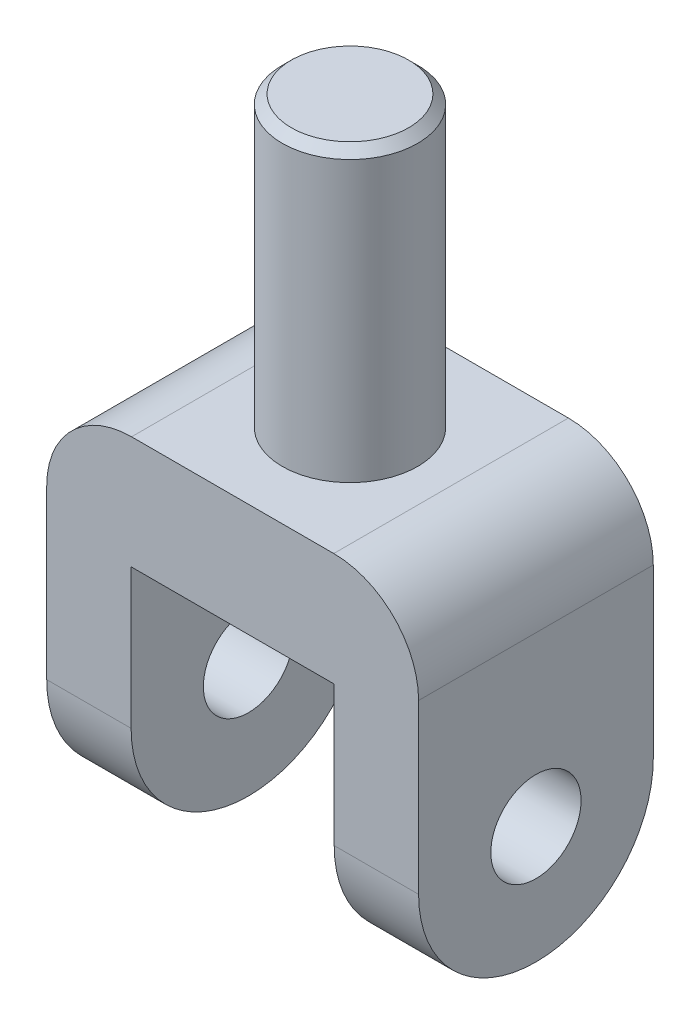
ISO-10303-21;
HEADER;
FILE_DESCRIPTION(('STEP AP214'),'2;1');
FILE_NAME('part.step','',(''),(''),'','','');
FILE_SCHEMA(('AUTOMOTIVE_DESIGN { 1 0 10303 214 1 1 1 1 }'));
ENDSEC;
DATA;
#1=APPLICATION_CONTEXT('core data for automotive mechanical design processes');
#2=APPLICATION_PROTOCOL_DEFINITION('international standard','automotive_design',2000,#1);
#3=PRODUCT_CONTEXT('',#1,'mechanical');
#4=PRODUCT('Part','Part','',(#3));
#5=PRODUCT_RELATED_PRODUCT_CATEGORY('part','',(#4));
#6=PRODUCT_DEFINITION_FORMATION('','',#4);
#7=PRODUCT_DEFINITION_CONTEXT('part definition',#1,'design');
#8=PRODUCT_DEFINITION('design','',#6,#7);
#9=PRODUCT_DEFINITION_SHAPE('','',#8);
#10=(LENGTH_UNIT() NAMED_UNIT(*) SI_UNIT(.MILLI.,.METRE.));
#11=(NAMED_UNIT(*) PLANE_ANGLE_UNIT() SI_UNIT($,.RADIAN.));
#12=(NAMED_UNIT(*) SI_UNIT($,.STERADIAN.) SOLID_ANGLE_UNIT());
#13=UNCERTAINTY_MEASURE_WITH_UNIT(LENGTH_MEASURE(1.E-05),#10,'distance_accuracy_value','');
#14=(GEOMETRIC_REPRESENTATION_CONTEXT(3) GLOBAL_UNCERTAINTY_ASSIGNED_CONTEXT((#13)) GLOBAL_UNIT_ASSIGNED_CONTEXT((#10,
#11,#12)) REPRESENTATION_CONTEXT('',''));
#15=CARTESIAN_POINT('',(0.,0.,0.));
#16=DIRECTION('',(0.,0.,1.));
#17=DIRECTION('',(1.,0.,0.));
#18=AXIS2_PLACEMENT_3D('',#15,#16,#17);
#19=CARTESIAN_POINT('',(0.,23.876,-33.02));
#20=DIRECTION('',(0.,1.,0.));
#21=DIRECTION('',(0.,0.,1.));
#22=AXIS2_PLACEMENT_3D('',#19,#20,#21);
#23=PLANE('',#22);
#24=CARTESIAN_POINT('',(0.,23.876,0.));
#25=DIRECTION('',(0.,1.,0.));
#26=DIRECTION('',(0.,0.,1.));
#27=AXIS2_PLACEMENT_3D('',#24,#25,#26);
#28=CIRCLE('',#27,19.05);
#29=CARTESIAN_POINT('',(0.,23.876,19.05));
#30=VERTEX_POINT('',#29);
#31=EDGE_CURVE('E169',#30,#30,#28,.T.);
#32=ORIENTED_EDGE('',*,*,#31,.F.);
#33=EDGE_LOOP('',(#32));
#34=FACE_BOUND('',#33,.T.);
#35=DIRECTION('',(0.,0.,1.));
#36=VECTOR('',#35,1.);
#37=CARTESIAN_POINT('',(-28.448,23.876,-33.02));
#38=LINE('',#37,#36);
#39=CARTESIAN_POINT('',(-28.448,23.876,-33.02));
#40=VERTEX_POINT('',#39);
#41=CARTESIAN_POINT('',(-28.448,23.876,33.02));
#42=VERTEX_POINT('',#41);
#43=EDGE_CURVE('E220',#40,#42,#38,.T.);
#44=ORIENTED_EDGE('',*,*,#43,.T.);
#45=DIRECTION('',(-1.,0.,0.));
#46=VECTOR('',#45,1.);
#47=CARTESIAN_POINT('',(0.,23.876,33.02));
#48=LINE('',#47,#46);
#49=CARTESIAN_POINT('',(28.448,23.876,33.02));
#50=VERTEX_POINT('',#49);
#51=EDGE_CURVE('E167',#50,#42,#48,.T.);
#52=ORIENTED_EDGE('',*,*,#51,.F.);
#53=DIRECTION('',(0.,0.,1.));
#54=VECTOR('',#53,1.);
#55=CARTESIAN_POINT('',(28.448,23.876,-33.02));
#56=LINE('',#55,#54);
#57=CARTESIAN_POINT('',(28.448,23.876,-33.02));
#58=VERTEX_POINT('',#57);
#59=EDGE_CURVE('E224',#58,#50,#56,.T.);
#60=ORIENTED_EDGE('',*,*,#59,.F.);
#61=DIRECTION('',(-1.,0.,0.));
#62=VECTOR('',#61,1.);
#63=CARTESIAN_POINT('',(0.,23.876,-33.02));
#64=LINE('',#63,#62);
#65=EDGE_CURVE('E152',#58,#40,#64,.T.);
#66=ORIENTED_EDGE('',*,*,#65,.T.);
#67=EDGE_LOOP('',(#44,#52,#60,#66));
#68=FACE_BOUND('',#67,.T.);
#69=ADVANCED_FACE('F48',(#34,#68),#23,.T.);
#70=CARTESIAN_POINT('',(-28.448,0.,-33.02));
#71=DIRECTION('',(0.,0.,1.));
#72=DIRECTION('',(1.,0.,0.));
#73=AXIS2_PLACEMENT_3D('',#70,#71,#72);
#74=CYLINDRICAL_SURFACE('',#73,23.876);
#75=DIRECTION('',(0.,0.,1.));
#76=VECTOR('',#75,1.);
#77=CARTESIAN_POINT('',(-52.324,0.,-33.02));
#78=LINE('',#77,#76);
#79=CARTESIAN_POINT('',(-52.324,0.,-33.02));
#80=VERTEX_POINT('',#79);
#81=CARTESIAN_POINT('',(-52.324,0.,33.02));
#82=VERTEX_POINT('',#81);
#83=EDGE_CURVE('E140',#80,#82,#78,.T.);
#84=ORIENTED_EDGE('',*,*,#83,.T.);
#85=CARTESIAN_POINT('',(-28.448,0.,33.02));
#86=DIRECTION('',(0.,0.,1.));
#87=DIRECTION('',(1.,0.,0.));
#88=AXIS2_PLACEMENT_3D('',#85,#86,#87);
#89=CIRCLE('',#88,23.876);
#90=EDGE_CURVE('E145',#82,#42,#89,.F.);
#91=ORIENTED_EDGE('',*,*,#90,.T.);
#92=ORIENTED_EDGE('',*,*,#43,.F.);
#93=CARTESIAN_POINT('',(-28.448,0.,-33.02));
#94=DIRECTION('',(0.,0.,1.));
#95=DIRECTION('',(1.,0.,0.));
#96=AXIS2_PLACEMENT_3D('',#93,#94,#95);
#97=CIRCLE('',#96,23.876);
#98=EDGE_CURVE('E146',#80,#40,#97,.F.);
#99=ORIENTED_EDGE('',*,*,#98,.F.);
#100=EDGE_LOOP('',(#84,#91,#92,#99));
#101=FACE_BOUND('',#100,.T.);
#102=ADVANCED_FACE('F142',(#101),#74,.T.);
#103=CARTESIAN_POINT('',(28.448,0.,-33.02));
#104=DIRECTION('',(0.,0.,1.));
#105=DIRECTION('',(1.,0.,0.));
#106=AXIS2_PLACEMENT_3D('',#103,#104,#105);
#107=CYLINDRICAL_SURFACE('',#106,23.876);
#108=ORIENTED_EDGE('',*,*,#59,.T.);
#109=CARTESIAN_POINT('',(28.448,0.,33.02));
#110=DIRECTION('',(0.,0.,1.));
#111=DIRECTION('',(1.,0.,0.));
#112=AXIS2_PLACEMENT_3D('',#109,#110,#111);
#113=CIRCLE('',#112,23.876);
#114=CARTESIAN_POINT('',(52.324,0.,33.02));
#115=VERTEX_POINT('',#114);
#116=EDGE_CURVE('E189',#115,#50,#113,.T.);
#117=ORIENTED_EDGE('',*,*,#116,.F.);
#118=DIRECTION('',(0.,0.,1.));
#119=VECTOR('',#118,1.);
#120=CARTESIAN_POINT('',(52.324,0.,-33.02));
#121=LINE('',#120,#119);
#122=CARTESIAN_POINT('',(52.324,0.,-33.02));
#123=VERTEX_POINT('',#122);
#124=EDGE_CURVE('E227',#123,#115,#121,.T.);
#125=ORIENTED_EDGE('',*,*,#124,.F.);
#126=CARTESIAN_POINT('',(28.448,0.,-33.02));
#127=DIRECTION('',(0.,0.,1.));
#128=DIRECTION('',(1.,0.,0.));
#129=AXIS2_PLACEMENT_3D('',#126,#127,#128);
#130=CIRCLE('',#129,23.876);
#131=EDGE_CURVE('E213',#123,#58,#130,.T.);
#132=ORIENTED_EDGE('',*,*,#131,.T.);
#133=EDGE_LOOP('',(#108,#117,#125,#132));
#134=FACE_BOUND('',#133,.T.);
#135=ADVANCED_FACE('F309',(#134),#107,.T.);
#136=CARTESIAN_POINT('',(52.324,0.,-33.02));
#137=DIRECTION('',(-1.,0.,0.));
#138=DIRECTION('',(0.,-1.,0.));
#139=AXIS2_PLACEMENT_3D('',#136,#137,#138);
#140=PLANE('',#139);
#141=CARTESIAN_POINT('',(52.324,-47.244,0.));
#142=DIRECTION('',(1.,0.,0.));
#143=DIRECTION('',(0.,0.,-1.));
#144=AXIS2_PLACEMENT_3D('',#141,#142,#143);
#145=CIRCLE('',#144,12.7);
#146=CARTESIAN_POINT('',(52.324,-47.244,-12.7));
#147=VERTEX_POINT('',#146);
#148=EDGE_CURVE('E298',#147,#147,#145,.T.);
#149=ORIENTED_EDGE('',*,*,#148,.F.);
#150=EDGE_LOOP('',(#149));
#151=FACE_BOUND('',#150,.T.);
#152=CARTESIAN_POINT('',(52.324,-47.244,0.));
#153=DIRECTION('',(-1.,0.,0.));
#154=DIRECTION('',(0.,-1.,0.));
#155=AXIS2_PLACEMENT_3D('',#152,#153,#154);
#156=CIRCLE('',#155,33.02);
#157=CARTESIAN_POINT('',(52.324,-47.244,33.02));
#158=VERTEX_POINT('',#157);
#159=CARTESIAN_POINT('',(52.324,-80.264,0.));
#160=VERTEX_POINT('',#159);
#161=EDGE_CURVE('E66',#158,#160,#156,.F.);
#162=ORIENTED_EDGE('',*,*,#161,.T.);
#163=CARTESIAN_POINT('',(52.324,-47.244,0.));
#164=DIRECTION('',(-1.,0.,0.));
#165=DIRECTION('',(0.,-1.,0.));
#166=AXIS2_PLACEMENT_3D('',#163,#164,#165);
#167=CIRCLE('',#166,33.02);
#168=CARTESIAN_POINT('',(52.324,-47.244,-33.02));
#169=VERTEX_POINT('',#168);
#170=EDGE_CURVE('E271',#160,#169,#167,.F.);
#171=ORIENTED_EDGE('',*,*,#170,.T.);
#172=DIRECTION('',(0.,-1.,0.));
#173=VECTOR('',#172,1.);
#174=CARTESIAN_POINT('',(52.324,0.,-33.02));
#175=LINE('',#174,#173);
#176=EDGE_CURVE('E209',#123,#169,#175,.T.);
#177=ORIENTED_EDGE('',*,*,#176,.F.);
#178=ORIENTED_EDGE('',*,*,#124,.T.);
#179=DIRECTION('',(0.,-1.,0.));
#180=VECTOR('',#179,1.);
#181=CARTESIAN_POINT('',(52.324,0.,33.02));
#182=LINE('',#181,#180);
#183=EDGE_CURVE('E186',#115,#158,#182,.T.);
#184=ORIENTED_EDGE('',*,*,#183,.T.);
#185=EDGE_LOOP('',(#162,#171,#177,#178,#184));
#186=FACE_BOUND('',#185,.T.);
#187=ADVANCED_FACE('F306',(#151,#186),#140,.F.);
#188=CARTESIAN_POINT('',(28.575,0.,-33.02));
#189=DIRECTION('',(1.,0.,0.));
#190=DIRECTION('',(0.,0.,-1.));
#191=AXIS2_PLACEMENT_3D('',#188,#189,#190);
#192=PLANE('',#191);
#193=CARTESIAN_POINT('',(28.575,-47.244,0.));
#194=DIRECTION('',(1.,0.,0.));
#195=DIRECTION('',(0.,0.,-1.));
#196=AXIS2_PLACEMENT_3D('',#193,#194,#195);
#197=CIRCLE('',#196,12.7);
#198=CARTESIAN_POINT('',(28.575,-47.244,-12.7));
#199=VERTEX_POINT('',#198);
#200=EDGE_CURVE('E287',#199,#199,#197,.T.);
#201=ORIENTED_EDGE('',*,*,#200,.T.);
#202=EDGE_LOOP('',(#201));
#203=FACE_BOUND('',#202,.T.);
#204=DIRECTION('',(0.,1.,0.));
#205=VECTOR('',#204,1.);
#206=CARTESIAN_POINT('',(28.575,0.,-33.02));
#207=LINE('',#206,#205);
#208=CARTESIAN_POINT('',(28.575,-47.244,-33.02));
#209=VERTEX_POINT('',#208);
#210=CARTESIAN_POINT('',(28.575,-7.87400000000002,-33.02));
#211=VERTEX_POINT('',#210);
#212=EDGE_CURVE('E206',#209,#211,#207,.T.);
#213=ORIENTED_EDGE('',*,*,#212,.F.);
#214=CARTESIAN_POINT('',(28.575,-47.244,0.));
#215=DIRECTION('',(1.,0.,0.));
#216=DIRECTION('',(0.,0.,-1.));
#217=AXIS2_PLACEMENT_3D('',#214,#215,#216);
#218=CIRCLE('',#217,33.02);
#219=CARTESIAN_POINT('',(28.575,-80.264,0.));
#220=VERTEX_POINT('',#219);
#221=EDGE_CURVE('E266',#209,#220,#218,.F.);
#222=ORIENTED_EDGE('',*,*,#221,.T.);
#223=CARTESIAN_POINT('',(28.575,-47.244,0.));
#224=DIRECTION('',(1.,0.,0.));
#225=DIRECTION('',(0.,0.,-1.));
#226=AXIS2_PLACEMENT_3D('',#223,#224,#225);
#227=CIRCLE('',#226,33.02);
#228=CARTESIAN_POINT('',(28.575,-47.244,33.02));
#229=VERTEX_POINT('',#228);
#230=EDGE_CURVE('E263',#220,#229,#227,.F.);
#231=ORIENTED_EDGE('',*,*,#230,.T.);
#232=DIRECTION('',(0.,1.,0.));
#233=VECTOR('',#232,1.);
#234=CARTESIAN_POINT('',(28.575,0.,33.02));
#235=LINE('',#234,#233);
#236=CARTESIAN_POINT('',(28.575,-7.87400000000002,33.02));
#237=VERTEX_POINT('',#236);
#238=EDGE_CURVE('E183',#229,#237,#235,.T.);
#239=ORIENTED_EDGE('',*,*,#238,.T.);
#240=DIRECTION('',(0.,0.,1.));
#241=VECTOR('',#240,1.);
#242=CARTESIAN_POINT('',(28.575,-7.87400000000002,-33.02));
#243=LINE('',#242,#241);
#244=EDGE_CURVE('E230',#211,#237,#243,.T.);
#245=ORIENTED_EDGE('',*,*,#244,.F.);
#246=EDGE_LOOP('',(#213,#222,#231,#239,#245));
#247=FACE_BOUND('',#246,.T.);
#248=ADVANCED_FACE('F308',(#203,#247),#192,.F.);
#249=CARTESIAN_POINT('',(0.,-7.87400000000002,-33.02));
#250=DIRECTION('',(0.,1.,0.));
#251=DIRECTION('',(0.,0.,1.));
#252=AXIS2_PLACEMENT_3D('',#249,#250,#251);
#253=PLANE('',#252);
#254=ORIENTED_EDGE('',*,*,#244,.T.);
#255=DIRECTION('',(-1.,0.,0.));
#256=VECTOR('',#255,1.);
#257=CARTESIAN_POINT('',(0.,-7.87400000000002,33.02));
#258=LINE('',#257,#256);
#259=CARTESIAN_POINT('',(-28.575,-7.87400000000002,33.02));
#260=VERTEX_POINT('',#259);
#261=EDGE_CURVE('E179',#237,#260,#258,.T.);
#262=ORIENTED_EDGE('',*,*,#261,.T.);
#263=DIRECTION('',(0.,0.,1.));
#264=VECTOR('',#263,1.);
#265=CARTESIAN_POINT('',(-28.575,-7.87400000000002,-33.02));
#266=LINE('',#265,#264);
#267=CARTESIAN_POINT('',(-28.575,-7.87400000000002,-33.02));
#268=VERTEX_POINT('',#267);
#269=EDGE_CURVE('E151',#268,#260,#266,.T.);
#270=ORIENTED_EDGE('',*,*,#269,.F.);
#271=DIRECTION('',(-1.,0.,0.));
#272=VECTOR('',#271,1.);
#273=CARTESIAN_POINT('',(0.,-7.87400000000002,-33.02));
#274=LINE('',#273,#272);
#275=EDGE_CURVE('E202',#211,#268,#274,.T.);
#276=ORIENTED_EDGE('',*,*,#275,.F.);
#277=EDGE_LOOP('',(#254,#262,#270,#276));
#278=FACE_BOUND('',#277,.T.);
#279=ADVANCED_FACE('F315',(#278),#253,.F.);
#280=CARTESIAN_POINT('',(-28.575,0.,-33.02));
#281=DIRECTION('',(1.,0.,0.));
#282=DIRECTION('',(0.,0.,-1.));
#283=AXIS2_PLACEMENT_3D('',#280,#281,#282);
#284=PLANE('',#283);
#285=CARTESIAN_POINT('',(-28.575,-47.244,0.));
#286=DIRECTION('',(1.,0.,0.));
#287=DIRECTION('',(0.,0.,-1.));
#288=AXIS2_PLACEMENT_3D('',#285,#286,#287);
#289=CIRCLE('',#288,12.7);
#290=CARTESIAN_POINT('',(-28.575,-47.244,-12.7));
#291=VERTEX_POINT('',#290);
#292=EDGE_CURVE('E282',#291,#291,#289,.T.);
#293=ORIENTED_EDGE('',*,*,#292,.F.);
#294=EDGE_LOOP('',(#293));
#295=FACE_BOUND('',#294,.T.);
#296=CARTESIAN_POINT('',(-28.575,-47.244,0.));
#297=DIRECTION('',(1.,0.,0.));
#298=DIRECTION('',(0.,0.,-1.));
#299=AXIS2_PLACEMENT_3D('',#296,#297,#298);
#300=CIRCLE('',#299,33.02);
#301=CARTESIAN_POINT('',(-28.575,-47.244,33.02));
#302=VERTEX_POINT('',#301);
#303=CARTESIAN_POINT('',(-28.575,-80.264,0.));
#304=VERTEX_POINT('',#303);
#305=EDGE_CURVE('E244',#302,#304,#300,.T.);
#306=ORIENTED_EDGE('',*,*,#305,.T.);
#307=CARTESIAN_POINT('',(-28.575,-47.244,0.));
#308=DIRECTION('',(1.,0.,0.));
#309=DIRECTION('',(0.,0.,-1.));
#310=AXIS2_PLACEMENT_3D('',#307,#308,#309);
#311=CIRCLE('',#310,33.02);
#312=CARTESIAN_POINT('',(-28.575,-47.244,-33.02));
#313=VERTEX_POINT('',#312);
#314=EDGE_CURVE('E247',#304,#313,#311,.T.);
#315=ORIENTED_EDGE('',*,*,#314,.T.);
#316=DIRECTION('',(0.,1.,0.));
#317=VECTOR('',#316,1.);
#318=CARTESIAN_POINT('',(-28.575,0.,-33.02));
#319=LINE('',#318,#317);
#320=EDGE_CURVE('E199',#313,#268,#319,.T.);
#321=ORIENTED_EDGE('',*,*,#320,.T.);
#322=ORIENTED_EDGE('',*,*,#269,.T.);
#323=DIRECTION('',(0.,1.,0.));
#324=VECTOR('',#323,1.);
#325=CARTESIAN_POINT('',(-28.575,0.,33.02));
#326=LINE('',#325,#324);
#327=EDGE_CURVE('E161',#302,#260,#326,.T.);
#328=ORIENTED_EDGE('',*,*,#327,.F.);
#329=EDGE_LOOP('',(#306,#315,#321,#322,#328));
#330=FACE_BOUND('',#329,.T.);
#331=ADVANCED_FACE('F356',(#295,#330),#284,.T.);
#332=CARTESIAN_POINT('',(-52.324,0.,-33.02));
#333=DIRECTION('',(-1.,0.,0.));
#334=DIRECTION('',(0.,-1.,0.));
#335=AXIS2_PLACEMENT_3D('',#332,#333,#334);
#336=PLANE('',#335);
#337=CARTESIAN_POINT('',(-52.324,-47.244,0.));
#338=DIRECTION('',(1.,0.,0.));
#339=DIRECTION('',(0.,0.,-1.));
#340=AXIS2_PLACEMENT_3D('',#337,#338,#339);
#341=CIRCLE('',#340,12.7);
#342=CARTESIAN_POINT('',(-52.324,-47.244,-12.7));
#343=VERTEX_POINT('',#342);
#344=EDGE_CURVE('E292',#343,#343,#341,.T.);
#345=ORIENTED_EDGE('',*,*,#344,.T.);
#346=EDGE_LOOP('',(#345));
#347=FACE_BOUND('',#346,.T.);
#348=DIRECTION('',(0.,-1.,0.));
#349=VECTOR('',#348,1.);
#350=CARTESIAN_POINT('',(-52.324,0.,-33.02));
#351=LINE('',#350,#349);
#352=CARTESIAN_POINT('',(-52.324,-47.244,-33.02));
#353=VERTEX_POINT('',#352);
#354=EDGE_CURVE('E196',#80,#353,#351,.T.);
#355=ORIENTED_EDGE('',*,*,#354,.T.);
#356=CARTESIAN_POINT('',(-52.324,-47.244,0.));
#357=DIRECTION('',(-1.,0.,0.));
#358=DIRECTION('',(0.,-1.,0.));
#359=AXIS2_PLACEMENT_3D('',#356,#357,#358);
#360=CIRCLE('',#359,33.02);
#361=CARTESIAN_POINT('',(-52.324,-80.264,0.));
#362=VERTEX_POINT('',#361);
#363=EDGE_CURVE('E260',#353,#362,#360,.T.);
#364=ORIENTED_EDGE('',*,*,#363,.T.);
#365=CARTESIAN_POINT('',(-52.324,-47.244,0.));
#366=DIRECTION('',(-1.,0.,0.));
#367=DIRECTION('',(0.,-1.,0.));
#368=AXIS2_PLACEMENT_3D('',#365,#366,#367);
#369=CIRCLE('',#368,33.02);
#370=CARTESIAN_POINT('',(-52.324,-47.244,33.02));
#371=VERTEX_POINT('',#370);
#372=EDGE_CURVE('E158',#362,#371,#369,.T.);
#373=ORIENTED_EDGE('',*,*,#372,.T.);
#374=DIRECTION('',(0.,-1.,0.));
#375=VECTOR('',#374,1.);
#376=CARTESIAN_POINT('',(-52.324,0.,33.02));
#377=LINE('',#376,#375);
#378=EDGE_CURVE('E155',#82,#371,#377,.T.);
#379=ORIENTED_EDGE('',*,*,#378,.F.);
#380=ORIENTED_EDGE('',*,*,#83,.F.);
#381=EDGE_LOOP('',(#355,#364,#373,#379,#380));
#382=FACE_BOUND('',#381,.T.);
#383=ADVANCED_FACE('F156',(#347,#382),#336,.T.);
#384=CARTESIAN_POINT('',(0.,0.,-33.02));
#385=DIRECTION('',(0.,0.,1.));
#386=DIRECTION('',(1.,0.,0.));
#387=AXIS2_PLACEMENT_3D('',#384,#385,#386);
#388=PLANE('',#387);
#389=ORIENTED_EDGE('',*,*,#320,.F.);
#390=DIRECTION('',(1.,0.,0.));
#391=VECTOR('',#390,1.);
#392=CARTESIAN_POINT('',(-52.324,-47.244,-33.02));
#393=LINE('',#392,#391);
#394=EDGE_CURVE('E254',#313,#353,#393,.F.);
#395=ORIENTED_EDGE('',*,*,#394,.T.);
#396=ORIENTED_EDGE('',*,*,#354,.F.);
#397=ORIENTED_EDGE('',*,*,#98,.T.);
#398=ORIENTED_EDGE('',*,*,#65,.F.);
#399=ORIENTED_EDGE('',*,*,#131,.F.);
#400=ORIENTED_EDGE('',*,*,#176,.T.);
#401=DIRECTION('',(-1.,0.,0.));
#402=VECTOR('',#401,1.);
#403=CARTESIAN_POINT('',(0.,-47.244,-33.02));
#404=LINE('',#403,#402);
#405=EDGE_CURVE('E250',#169,#209,#404,.T.);
#406=ORIENTED_EDGE('',*,*,#405,.T.);
#407=ORIENTED_EDGE('',*,*,#212,.T.);
#408=ORIENTED_EDGE('',*,*,#275,.T.);
#409=EDGE_LOOP('',(#389,#395,#396,#397,#398,#399,#400,#406,#407,#408));
#410=FACE_BOUND('',#409,.T.);
#411=ADVANCED_FACE('F330',(#410),#388,.F.);
#412=CARTESIAN_POINT('',(0.,0.,33.02));
#413=DIRECTION('',(0.,0.,1.));
#414=DIRECTION('',(1.,0.,0.));
#415=AXIS2_PLACEMENT_3D('',#412,#413,#414);
#416=PLANE('',#415);
#417=ORIENTED_EDGE('',*,*,#238,.F.);
#418=DIRECTION('',(-1.,0.,0.));
#419=VECTOR('',#418,1.);
#420=CARTESIAN_POINT('',(52.324,-47.244,33.02));
#421=LINE('',#420,#419);
#422=EDGE_CURVE('E12',#229,#158,#421,.F.);
#423=ORIENTED_EDGE('',*,*,#422,.T.);
#424=ORIENTED_EDGE('',*,*,#183,.F.);
#425=ORIENTED_EDGE('',*,*,#116,.T.);
#426=ORIENTED_EDGE('',*,*,#51,.T.);
#427=ORIENTED_EDGE('',*,*,#90,.F.);
#428=ORIENTED_EDGE('',*,*,#378,.T.);
#429=DIRECTION('',(1.,0.,0.));
#430=VECTOR('',#429,1.);
#431=CARTESIAN_POINT('',(0.,-47.244,33.02));
#432=LINE('',#431,#430);
#433=EDGE_CURVE('E58',#371,#302,#432,.T.);
#434=ORIENTED_EDGE('',*,*,#433,.T.);
#435=ORIENTED_EDGE('',*,*,#327,.T.);
#436=ORIENTED_EDGE('',*,*,#261,.F.);
#437=EDGE_LOOP('',(#417,#423,#424,#425,#426,#427,#428,#434,#435,#436));
#438=FACE_BOUND('',#437,.T.);
#439=ADVANCED_FACE('F164',(#438),#416,.T.);
#440=CARTESIAN_POINT('',(0.,23.876,0.));
#441=DIRECTION('',(0.,1.,0.));
#442=DIRECTION('',(0.,0.,1.));
#443=AXIS2_PLACEMENT_3D('',#440,#441,#442);
#444=CYLINDRICAL_SURFACE('',#443,19.05);
#445=CARTESIAN_POINT('',(0.,102.616,0.));
#446=DIRECTION('',(0.,1.,0.));
#447=DIRECTION('',(0.,0.,1.));
#448=AXIS2_PLACEMENT_3D('',#445,#446,#447);
#449=CIRCLE('',#448,19.05);
#450=CARTESIAN_POINT('',(0.,102.616,19.05));
#451=VERTEX_POINT('',#450);
#452=EDGE_CURVE('E240',#451,#451,#449,.F.);
#453=ORIENTED_EDGE('',*,*,#452,.T.);
#454=EDGE_LOOP('',(#453));
#455=FACE_BOUND('',#454,.T.);
#456=ORIENTED_EDGE('',*,*,#31,.T.);
#457=EDGE_LOOP('',(#456));
#458=FACE_BOUND('',#457,.T.);
#459=ADVANCED_FACE('F336',(#455,#458),#444,.T.);
#460=CARTESIAN_POINT('',(0.,105.156,-19.05));
#461=DIRECTION('',(0.,1.,0.));
#462=DIRECTION('',(0.,0.,1.));
#463=AXIS2_PLACEMENT_3D('',#460,#461,#462);
#464=PLANE('',#463);
#465=CARTESIAN_POINT('',(0.,105.156,0.));
#466=DIRECTION('',(0.,1.,0.));
#467=DIRECTION('',(0.,0.,1.));
#468=AXIS2_PLACEMENT_3D('',#465,#466,#467);
#469=CIRCLE('',#468,16.51);
#470=CARTESIAN_POINT('',(0.,105.156,16.51));
#471=VERTEX_POINT('',#470);
#472=EDGE_CURVE('E223',#471,#471,#469,.T.);
#473=ORIENTED_EDGE('',*,*,#472,.T.);
#474=EDGE_LOOP('',(#473));
#475=FACE_BOUND('',#474,.T.);
#476=ADVANCED_FACE('F337',(#475),#464,.T.);
#477=CARTESIAN_POINT('',(0.,105.156,0.));
#478=DIRECTION('',(0.,-1.,0.));
#479=DIRECTION('',(0.,0.,-1.));
#480=AXIS2_PLACEMENT_3D('',#477,#478,#479);
#481=CONICAL_SURFACE('',#480,16.51,0.785398163397443);
#482=ORIENTED_EDGE('',*,*,#452,.F.);
#483=EDGE_LOOP('',(#482));
#484=FACE_BOUND('',#483,.T.);
#485=ORIENTED_EDGE('',*,*,#472,.F.);
#486=EDGE_LOOP('',(#485));
#487=FACE_BOUND('',#486,.T.);
#488=ADVANCED_FACE('F340',(#484,#487),#481,.T.);
#489=CARTESIAN_POINT('',(0.,-47.244,0.));
#490=DIRECTION('',(1.,0.,0.));
#491=DIRECTION('',(0.,0.,-1.));
#492=AXIS2_PLACEMENT_3D('',#489,#490,#491);
#493=CYLINDRICAL_SURFACE('',#492,33.02);
#494=ORIENTED_EDGE('',*,*,#433,.F.);
#495=ORIENTED_EDGE('',*,*,#372,.F.);
#496=DIRECTION('',(1.,0.,0.));
#497=VECTOR('',#496,1.);
#498=CARTESIAN_POINT('',(0.,-80.264,0.));
#499=LINE('',#498,#497);
#500=EDGE_CURVE('E173',#304,#362,#499,.F.);
#501=ORIENTED_EDGE('',*,*,#500,.F.);
#502=ORIENTED_EDGE('',*,*,#305,.F.);
#503=EDGE_LOOP('',(#494,#495,#501,#502));
#504=FACE_BOUND('',#503,.T.);
#505=ADVANCED_FACE('F370',(#504),#493,.T.);
#506=CARTESIAN_POINT('',(0.,-47.244,0.));
#507=DIRECTION('',(-1.,0.,0.));
#508=DIRECTION('',(0.,0.,1.));
#509=AXIS2_PLACEMENT_3D('',#506,#507,#508);
#510=CYLINDRICAL_SURFACE('',#509,33.02);
#511=ORIENTED_EDGE('',*,*,#363,.F.);
#512=ORIENTED_EDGE('',*,*,#394,.F.);
#513=ORIENTED_EDGE('',*,*,#314,.F.);
#514=ORIENTED_EDGE('',*,*,#500,.T.);
#515=EDGE_LOOP('',(#511,#512,#513,#514));
#516=FACE_BOUND('',#515,.T.);
#517=ADVANCED_FACE('F372',(#516),#510,.T.);
#518=CARTESIAN_POINT('',(0.,-47.244,0.));
#519=DIRECTION('',(1.,0.,0.));
#520=DIRECTION('',(0.,0.,-1.));
#521=AXIS2_PLACEMENT_3D('',#518,#519,#520);
#522=CYLINDRICAL_SURFACE('',#521,33.02);
#523=DIRECTION('',(-1.,0.,0.));
#524=VECTOR('',#523,1.);
#525=CARTESIAN_POINT('',(28.575,-80.264,0.));
#526=LINE('',#525,#524);
#527=EDGE_CURVE('E52',#160,#220,#526,.T.);
#528=ORIENTED_EDGE('',*,*,#527,.F.);
#529=ORIENTED_EDGE('',*,*,#161,.F.);
#530=ORIENTED_EDGE('',*,*,#422,.F.);
#531=ORIENTED_EDGE('',*,*,#230,.F.);
#532=EDGE_LOOP('',(#528,#529,#530,#531));
#533=FACE_BOUND('',#532,.T.);
#534=ADVANCED_FACE('F50',(#533),#522,.T.);
#535=CARTESIAN_POINT('',(0.,-47.244,0.));
#536=DIRECTION('',(-1.,0.,0.));
#537=DIRECTION('',(0.,0.,1.));
#538=AXIS2_PLACEMENT_3D('',#535,#536,#537);
#539=CYLINDRICAL_SURFACE('',#538,33.02);
#540=ORIENTED_EDGE('',*,*,#170,.F.);
#541=ORIENTED_EDGE('',*,*,#527,.T.);
#542=ORIENTED_EDGE('',*,*,#221,.F.);
#543=ORIENTED_EDGE('',*,*,#405,.F.);
#544=EDGE_LOOP('',(#540,#541,#542,#543));
#545=FACE_BOUND('',#544,.T.);
#546=ADVANCED_FACE('F347',(#545),#539,.T.);
#547=CARTESIAN_POINT('',(52.324,-47.244,0.));
#548=DIRECTION('',(1.,0.,0.));
#549=DIRECTION('',(0.,0.,-1.));
#550=AXIS2_PLACEMENT_3D('',#547,#548,#549);
#551=CYLINDRICAL_SURFACE('',#550,12.7);
#552=ORIENTED_EDGE('',*,*,#292,.T.);
#553=EDGE_LOOP('',(#552));
#554=FACE_BOUND('',#553,.T.);
#555=ORIENTED_EDGE('',*,*,#344,.F.);
#556=EDGE_LOOP('',(#555));
#557=FACE_BOUND('',#556,.T.);
#558=ADVANCED_FACE('F345',(#554,#557),#551,.F.);
#559=ORIENTED_EDGE('',*,*,#148,.T.);
#560=EDGE_LOOP('',(#559));
#561=FACE_BOUND('',#560,.T.);
#562=ORIENTED_EDGE('',*,*,#200,.F.);
#563=EDGE_LOOP('',(#562));
#564=FACE_BOUND('',#563,.T.);
#565=ADVANCED_FACE('F303',(#561,#564),#551,.F.);
#566=CLOSED_SHELL('',(#69,#102,#135,#187,#248,#279,#331,#383,#411,#439,#459,#476,#488,#505,#517,
#534,#546,#558,#565));
#567=MANIFOLD_SOLID_BREP('B2',#566);
#568=ADVANCED_BREP_SHAPE_REPRESENTATION('',(#18,#567),#14);
#569=SHAPE_DEFINITION_REPRESENTATION(#9,#568);
ENDSEC;
END-ISO-10303-21;
